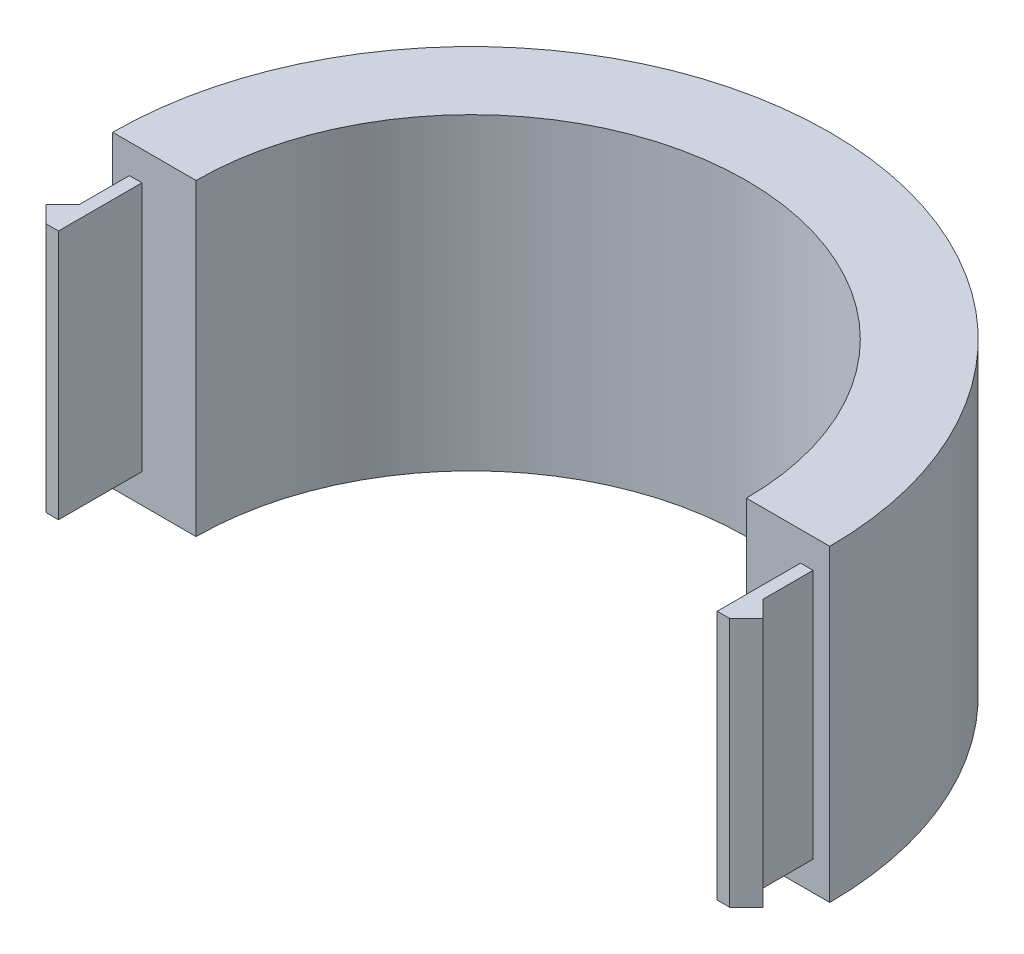
ISO-10303-21;
HEADER;
FILE_DESCRIPTION(('STEP AP214'),'2;1');
FILE_NAME('part.step','',(''),(''),'','','');
FILE_SCHEMA(('AUTOMOTIVE_DESIGN { 1 0 10303 214 1 1 1 1 }'));
ENDSEC;
DATA;
#1=APPLICATION_CONTEXT('core data for automotive mechanical design processes');
#2=APPLICATION_PROTOCOL_DEFINITION('international standard','automotive_design',2000,#1);
#3=PRODUCT_CONTEXT('',#1,'mechanical');
#4=PRODUCT('Part','Part','',(#3));
#5=PRODUCT_RELATED_PRODUCT_CATEGORY('part','',(#4));
#6=PRODUCT_DEFINITION_FORMATION('','',#4);
#7=PRODUCT_DEFINITION_CONTEXT('part definition',#1,'design');
#8=PRODUCT_DEFINITION('design','',#6,#7);
#9=PRODUCT_DEFINITION_SHAPE('','',#8);
#10=(LENGTH_UNIT() NAMED_UNIT(*) SI_UNIT(.MILLI.,.METRE.));
#11=(NAMED_UNIT(*) PLANE_ANGLE_UNIT() SI_UNIT($,.RADIAN.));
#12=(NAMED_UNIT(*) SI_UNIT($,.STERADIAN.) SOLID_ANGLE_UNIT());
#13=UNCERTAINTY_MEASURE_WITH_UNIT(LENGTH_MEASURE(1.E-05),#10,'distance_accuracy_value','');
#14=(GEOMETRIC_REPRESENTATION_CONTEXT(3) GLOBAL_UNCERTAINTY_ASSIGNED_CONTEXT((#13)) GLOBAL_UNIT_ASSIGNED_CONTEXT((#10,
#11,#12)) REPRESENTATION_CONTEXT('',''));
#15=CARTESIAN_POINT('',(0.,0.,0.));
#16=DIRECTION('',(0.,0.,1.));
#17=DIRECTION('',(1.,0.,0.));
#18=AXIS2_PLACEMENT_3D('',#15,#16,#17);
#19=CARTESIAN_POINT('',(0.,37.,0.));
#20=DIRECTION('',(0.,0.,-1.));
#21=DIRECTION('',(-1.,0.,0.));
#22=AXIS2_PLACEMENT_3D('',#19,#20,#21);
#23=PLANE('',#22);
#24=DIRECTION('',(0.,-1.,0.));
#25=VECTOR('',#24,1.);
#26=CARTESIAN_POINT('',(39.5,33.5,0.));
#27=LINE('',#26,#25);
#28=CARTESIAN_POINT('',(39.5,33.5,0.));
#29=VERTEX_POINT('',#28);
#30=CARTESIAN_POINT('',(39.5,3.5,0.));
#31=VERTEX_POINT('',#30);
#32=EDGE_CURVE('E61',#29,#31,#27,.T.);
#33=ORIENTED_EDGE('',*,*,#32,.F.);
#34=DIRECTION('',(1.,0.,0.));
#35=VECTOR('',#34,1.);
#36=CARTESIAN_POINT('',(0.,33.5,0.));
#37=LINE('',#36,#35);
#38=CARTESIAN_POINT('',(41.,33.5,0.));
#39=VERTEX_POINT('',#38);
#40=EDGE_CURVE('E66',#29,#39,#37,.T.);
#41=ORIENTED_EDGE('',*,*,#40,.T.);
#42=DIRECTION('',(0.,-1.,0.));
#43=VECTOR('',#42,1.);
#44=CARTESIAN_POINT('',(41.,33.5,0.));
#45=LINE('',#44,#43);
#46=CARTESIAN_POINT('',(41.,3.5,0.));
#47=VERTEX_POINT('',#46);
#48=EDGE_CURVE('E193',#39,#47,#45,.T.);
#49=ORIENTED_EDGE('',*,*,#48,.T.);
#50=DIRECTION('',(1.,0.,0.));
#51=VECTOR('',#50,1.);
#52=CARTESIAN_POINT('',(0.,3.5,0.));
#53=LINE('',#52,#51);
#54=EDGE_CURVE('E194',#31,#47,#53,.T.);
#55=ORIENTED_EDGE('',*,*,#54,.F.);
#56=EDGE_LOOP('',(#33,#41,#49,#55));
#57=FACE_BOUND('',#56,.T.);
#58=DIRECTION('',(1.,0.,0.));
#59=VECTOR('',#58,1.);
#60=CARTESIAN_POINT('',(0.,0.,0.));
#61=LINE('',#60,#59);
#62=CARTESIAN_POINT('',(33.,0.,0.));
#63=VERTEX_POINT('',#62);
#64=CARTESIAN_POINT('',(43.,0.,0.));
#65=VERTEX_POINT('',#64);
#66=EDGE_CURVE('E292',#63,#65,#61,.T.);
#67=ORIENTED_EDGE('',*,*,#66,.T.);
#68=DIRECTION('',(0.,-1.,0.));
#69=VECTOR('',#68,1.);
#70=CARTESIAN_POINT('',(43.,37.,0.));
#71=LINE('',#70,#69);
#72=CARTESIAN_POINT('',(43.,37.,0.));
#73=VERTEX_POINT('',#72);
#74=EDGE_CURVE('E11',#73,#65,#71,.T.);
#75=ORIENTED_EDGE('',*,*,#74,.F.);
#76=DIRECTION('',(1.,0.,0.));
#77=VECTOR('',#76,1.);
#78=CARTESIAN_POINT('',(0.,37.,0.));
#79=LINE('',#78,#77);
#80=CARTESIAN_POINT('',(33.,37.,0.));
#81=VERTEX_POINT('',#80);
#82=EDGE_CURVE('E293',#81,#73,#79,.T.);
#83=ORIENTED_EDGE('',*,*,#82,.F.);
#84=DIRECTION('',(0.,-1.,0.));
#85=VECTOR('',#84,1.);
#86=CARTESIAN_POINT('',(33.,37.,0.));
#87=LINE('',#86,#85);
#88=EDGE_CURVE('E306',#81,#63,#87,.T.);
#89=ORIENTED_EDGE('',*,*,#88,.T.);
#90=EDGE_LOOP('',(#67,#75,#83,#89));
#91=FACE_BOUND('',#90,.T.);
#92=ADVANCED_FACE('F45',(#57,#91),#23,.F.);
#93=CARTESIAN_POINT('',(0.,37.,0.));
#94=DIRECTION('',(0.,-1.,0.));
#95=DIRECTION('',(0.,0.,-1.));
#96=AXIS2_PLACEMENT_3D('',#93,#94,#95);
#97=CYLINDRICAL_SURFACE('',#96,43.);
#98=CARTESIAN_POINT('',(0.,0.,0.));
#99=DIRECTION('',(0.,1.,0.));
#100=DIRECTION('',(0.,0.,1.));
#101=AXIS2_PLACEMENT_3D('',#98,#99,#100);
#102=CIRCLE('',#101,43.);
#103=CARTESIAN_POINT('',(-43.,0.,0.));
#104=VERTEX_POINT('',#103);
#105=EDGE_CURVE('E310',#65,#104,#102,.T.);
#106=ORIENTED_EDGE('',*,*,#105,.T.);
#107=DIRECTION('',(0.,-1.,0.));
#108=VECTOR('',#107,1.);
#109=CARTESIAN_POINT('',(-43.,37.,0.));
#110=LINE('',#109,#108);
#111=CARTESIAN_POINT('',(-43.,37.,0.));
#112=VERTEX_POINT('',#111);
#113=EDGE_CURVE('E54',#112,#104,#110,.T.);
#114=ORIENTED_EDGE('',*,*,#113,.F.);
#115=CARTESIAN_POINT('',(0.,37.,0.));
#116=DIRECTION('',(0.,1.,0.));
#117=DIRECTION('',(0.,0.,1.));
#118=AXIS2_PLACEMENT_3D('',#115,#116,#117);
#119=CIRCLE('',#118,43.);
#120=EDGE_CURVE('E297',#73,#112,#119,.T.);
#121=ORIENTED_EDGE('',*,*,#120,.F.);
#122=ORIENTED_EDGE('',*,*,#74,.T.);
#123=EDGE_LOOP('',(#106,#114,#121,#122));
#124=FACE_BOUND('',#123,.T.);
#125=ADVANCED_FACE('F47',(#124),#97,.T.);
#126=DIRECTION('',(0.,-1.,0.));
#127=VECTOR('',#126,1.);
#128=CARTESIAN_POINT('',(-41.,33.5,0.));
#129=LINE('',#128,#127);
#130=CARTESIAN_POINT('',(-41.,33.5,0.));
#131=VERTEX_POINT('',#130);
#132=CARTESIAN_POINT('',(-41.,3.5,0.));
#133=VERTEX_POINT('',#132);
#134=EDGE_CURVE('E288',#131,#133,#129,.T.);
#135=ORIENTED_EDGE('',*,*,#134,.F.);
#136=DIRECTION('',(-1.,0.,0.));
#137=VECTOR('',#136,1.);
#138=CARTESIAN_POINT('',(0.,33.5,0.));
#139=LINE('',#138,#137);
#140=CARTESIAN_POINT('',(-39.5,33.5,0.));
#141=VERTEX_POINT('',#140);
#142=EDGE_CURVE('E228',#141,#131,#139,.T.);
#143=ORIENTED_EDGE('',*,*,#142,.F.);
#144=DIRECTION('',(0.,-1.,0.));
#145=VECTOR('',#144,1.);
#146=CARTESIAN_POINT('',(-39.5,33.5,0.));
#147=LINE('',#146,#145);
#148=CARTESIAN_POINT('',(-39.5,3.5,0.));
#149=VERTEX_POINT('',#148);
#150=EDGE_CURVE('E252',#141,#149,#147,.T.);
#151=ORIENTED_EDGE('',*,*,#150,.T.);
#152=DIRECTION('',(-1.,0.,0.));
#153=VECTOR('',#152,1.);
#154=CARTESIAN_POINT('',(0.,3.5,0.));
#155=LINE('',#154,#153);
#156=EDGE_CURVE('E227',#149,#133,#155,.T.);
#157=ORIENTED_EDGE('',*,*,#156,.T.);
#158=EDGE_LOOP('',(#135,#143,#151,#157));
#159=FACE_BOUND('',#158,.T.);
#160=CARTESIAN_POINT('',(-33.,0.,0.));
#161=VERTEX_POINT('',#160);
#162=EDGE_CURVE('E311',#104,#161,#61,.T.);
#163=ORIENTED_EDGE('',*,*,#162,.T.);
#164=DIRECTION('',(0.,-1.,0.));
#165=VECTOR('',#164,1.);
#166=CARTESIAN_POINT('',(-33.,37.,0.));
#167=LINE('',#166,#165);
#168=CARTESIAN_POINT('',(-33.,37.,0.));
#169=VERTEX_POINT('',#168);
#170=EDGE_CURVE('E319',#169,#161,#167,.T.);
#171=ORIENTED_EDGE('',*,*,#170,.F.);
#172=EDGE_CURVE('E299',#112,#169,#79,.T.);
#173=ORIENTED_EDGE('',*,*,#172,.F.);
#174=ORIENTED_EDGE('',*,*,#113,.T.);
#175=EDGE_LOOP('',(#163,#171,#173,#174));
#176=FACE_BOUND('',#175,.T.);
#177=ADVANCED_FACE('F328',(#159,#176),#23,.F.);
#178=CARTESIAN_POINT('',(0.,37.,0.));
#179=DIRECTION('',(0.,-1.,0.));
#180=DIRECTION('',(0.,0.,-1.));
#181=AXIS2_PLACEMENT_3D('',#178,#179,#180);
#182=CYLINDRICAL_SURFACE('',#181,33.);
#183=CARTESIAN_POINT('',(0.,0.,0.));
#184=DIRECTION('',(0.,1.,0.));
#185=DIRECTION('',(0.,0.,1.));
#186=AXIS2_PLACEMENT_3D('',#183,#184,#185);
#187=CIRCLE('',#186,33.);
#188=EDGE_CURVE('E298',#63,#161,#187,.T.);
#189=ORIENTED_EDGE('',*,*,#188,.F.);
#190=ORIENTED_EDGE('',*,*,#88,.F.);
#191=CARTESIAN_POINT('',(0.,37.,0.));
#192=DIRECTION('',(0.,1.,0.));
#193=DIRECTION('',(0.,0.,1.));
#194=AXIS2_PLACEMENT_3D('',#191,#192,#193);
#195=CIRCLE('',#194,33.);
#196=EDGE_CURVE('E302',#81,#169,#195,.T.);
#197=ORIENTED_EDGE('',*,*,#196,.T.);
#198=ORIENTED_EDGE('',*,*,#170,.T.);
#199=EDGE_LOOP('',(#189,#190,#197,#198));
#200=FACE_BOUND('',#199,.T.);
#201=ADVANCED_FACE('F341',(#200),#182,.F.);
#202=CARTESIAN_POINT('',(0.,37.,0.));
#203=DIRECTION('',(0.,1.,0.));
#204=DIRECTION('',(0.,0.,1.));
#205=AXIS2_PLACEMENT_3D('',#202,#203,#204);
#206=PLANE('',#205);
#207=ORIENTED_EDGE('',*,*,#82,.T.);
#208=ORIENTED_EDGE('',*,*,#120,.T.);
#209=ORIENTED_EDGE('',*,*,#172,.T.);
#210=ORIENTED_EDGE('',*,*,#196,.F.);
#211=EDGE_LOOP('',(#207,#208,#209,#210));
#212=FACE_BOUND('',#211,.T.);
#213=ADVANCED_FACE('F339',(#212),#206,.T.);
#214=CARTESIAN_POINT('',(0.,0.,0.));
#215=DIRECTION('',(0.,1.,0.));
#216=DIRECTION('',(0.,0.,1.));
#217=AXIS2_PLACEMENT_3D('',#214,#215,#216);
#218=PLANE('',#217);
#219=ORIENTED_EDGE('',*,*,#66,.F.);
#220=ORIENTED_EDGE('',*,*,#188,.T.);
#221=ORIENTED_EDGE('',*,*,#162,.F.);
#222=ORIENTED_EDGE('',*,*,#105,.F.);
#223=EDGE_LOOP('',(#219,#220,#221,#222));
#224=FACE_BOUND('',#223,.T.);
#225=ADVANCED_FACE('F333',(#224),#218,.F.);
#226=CARTESIAN_POINT('',(-41.,33.5,0.));
#227=DIRECTION('',(1.,0.,0.));
#228=DIRECTION('',(0.,0.,-1.));
#229=AXIS2_PLACEMENT_3D('',#226,#227,#228);
#230=PLANE('',#229);
#231=DIRECTION('',(0.,0.,1.));
#232=VECTOR('',#231,1.);
#233=CARTESIAN_POINT('',(-41.,3.5,0.));
#234=LINE('',#233,#232);
#235=CARTESIAN_POINT('',(-41.,3.5,5.99999999999995));
#236=VERTEX_POINT('',#235);
#237=EDGE_CURVE('E255',#133,#236,#234,.T.);
#238=ORIENTED_EDGE('',*,*,#237,.T.);
#239=DIRECTION('',(0.,-1.,0.));
#240=VECTOR('',#239,1.);
#241=CARTESIAN_POINT('',(-41.,33.5,5.99999999999995));
#242=LINE('',#241,#240);
#243=CARTESIAN_POINT('',(-41.,33.5,5.99999999999995));
#244=VERTEX_POINT('',#243);
#245=EDGE_CURVE('E285',#244,#236,#242,.T.);
#246=ORIENTED_EDGE('',*,*,#245,.F.);
#247=DIRECTION('',(0.,0.,1.));
#248=VECTOR('',#247,1.);
#249=CARTESIAN_POINT('',(-41.,33.5,0.));
#250=LINE('',#249,#248);
#251=EDGE_CURVE('E232',#131,#244,#250,.T.);
#252=ORIENTED_EDGE('',*,*,#251,.F.);
#253=ORIENTED_EDGE('',*,*,#134,.T.);
#254=EDGE_LOOP('',(#238,#246,#252,#253));
#255=FACE_BOUND('',#254,.T.);
#256=ADVANCED_FACE('F358',(#255),#230,.F.);
#257=CARTESIAN_POINT('',(-17.5000000000003,33.5,-17.5000000000001));
#258=DIRECTION('',(-0.707106781186552,0.,-0.707106781186543));
#259=DIRECTION('',(-0.707106781186543,0.,0.707106781186552));
#260=AXIS2_PLACEMENT_3D('',#257,#258,#259);
#261=PLANE('',#260);
#262=DIRECTION('',(0.707106781186543,0.,-0.707106781186552));
#263=VECTOR('',#262,1.);
#264=CARTESIAN_POINT('',(-17.5000000000003,3.5,-17.5000000000001));
#265=LINE('',#264,#263);
#266=CARTESIAN_POINT('',(-43.,3.5,7.99999999999998));
#267=VERTEX_POINT('',#266);
#268=EDGE_CURVE('E259',#267,#236,#265,.T.);
#269=ORIENTED_EDGE('',*,*,#268,.F.);
#270=DIRECTION('',(0.,-1.,0.));
#271=VECTOR('',#270,1.);
#272=CARTESIAN_POINT('',(-43.,33.5,7.99999999999998));
#273=LINE('',#272,#271);
#274=CARTESIAN_POINT('',(-43.,33.5,7.99999999999998));
#275=VERTEX_POINT('',#274);
#276=EDGE_CURVE('E282',#275,#267,#273,.T.);
#277=ORIENTED_EDGE('',*,*,#276,.F.);
#278=DIRECTION('',(0.707106781186543,0.,-0.707106781186552));
#279=VECTOR('',#278,1.);
#280=CARTESIAN_POINT('',(-17.5000000000003,33.5,-17.5000000000001));
#281=LINE('',#280,#279);
#282=EDGE_CURVE('E236',#275,#244,#281,.T.);
#283=ORIENTED_EDGE('',*,*,#282,.T.);
#284=ORIENTED_EDGE('',*,*,#245,.T.);
#285=EDGE_LOOP('',(#269,#277,#283,#284));
#286=FACE_BOUND('',#285,.T.);
#287=ADVANCED_FACE('F363',(#286),#261,.T.);
#288=CARTESIAN_POINT('',(-25.5000000000002,33.5,25.5));
#289=DIRECTION('',(-0.707106781186551,0.,0.707106781186544));
#290=DIRECTION('',(0.707106781186544,0.,0.707106781186551));
#291=AXIS2_PLACEMENT_3D('',#288,#289,#290);
#292=PLANE('',#291);
#293=DIRECTION('',(-0.707106781186544,0.,-0.707106781186551));
#294=VECTOR('',#293,1.);
#295=CARTESIAN_POINT('',(-25.5000000000002,3.5,25.5));
#296=LINE('',#295,#294);
#297=CARTESIAN_POINT('',(-41.,3.5,10.));
#298=VERTEX_POINT('',#297);
#299=EDGE_CURVE('E263',#298,#267,#296,.T.);
#300=ORIENTED_EDGE('',*,*,#299,.F.);
#301=DIRECTION('',(0.,-1.,0.));
#302=VECTOR('',#301,1.);
#303=CARTESIAN_POINT('',(-41.,33.5,10.));
#304=LINE('',#303,#302);
#305=CARTESIAN_POINT('',(-41.,33.5,10.));
#306=VERTEX_POINT('',#305);
#307=EDGE_CURVE('E279',#306,#298,#304,.T.);
#308=ORIENTED_EDGE('',*,*,#307,.F.);
#309=DIRECTION('',(-0.707106781186544,0.,-0.707106781186551));
#310=VECTOR('',#309,1.);
#311=CARTESIAN_POINT('',(-25.5000000000002,33.5,25.5));
#312=LINE('',#311,#310);
#313=EDGE_CURVE('E240',#306,#275,#312,.T.);
#314=ORIENTED_EDGE('',*,*,#313,.T.);
#315=ORIENTED_EDGE('',*,*,#276,.T.);
#316=EDGE_LOOP('',(#300,#308,#314,#315));
#317=FACE_BOUND('',#316,.T.);
#318=ADVANCED_FACE('F367',(#317),#292,.T.);
#319=CARTESIAN_POINT('',(0.,33.5,9.99999999999995));
#320=DIRECTION('',(0.,0.,1.));
#321=DIRECTION('',(1.,0.,0.));
#322=AXIS2_PLACEMENT_3D('',#319,#320,#321);
#323=PLANE('',#322);
#324=DIRECTION('',(-1.,0.,0.));
#325=VECTOR('',#324,1.);
#326=CARTESIAN_POINT('',(0.,3.5,9.99999999999995));
#327=LINE('',#326,#325);
#328=CARTESIAN_POINT('',(-39.5,3.5,10.));
#329=VERTEX_POINT('',#328);
#330=EDGE_CURVE('E267',#329,#298,#327,.T.);
#331=ORIENTED_EDGE('',*,*,#330,.F.);
#332=DIRECTION('',(0.,-1.,0.));
#333=VECTOR('',#332,1.);
#334=CARTESIAN_POINT('',(-39.5,33.5,10.));
#335=LINE('',#334,#333);
#336=CARTESIAN_POINT('',(-39.5,33.5,10.));
#337=VERTEX_POINT('',#336);
#338=EDGE_CURVE('E276',#337,#329,#335,.T.);
#339=ORIENTED_EDGE('',*,*,#338,.F.);
#340=DIRECTION('',(-1.,0.,0.));
#341=VECTOR('',#340,1.);
#342=CARTESIAN_POINT('',(0.,33.5,9.99999999999995));
#343=LINE('',#342,#341);
#344=EDGE_CURVE('E244',#337,#306,#343,.T.);
#345=ORIENTED_EDGE('',*,*,#344,.T.);
#346=ORIENTED_EDGE('',*,*,#307,.T.);
#347=EDGE_LOOP('',(#331,#339,#345,#346));
#348=FACE_BOUND('',#347,.T.);
#349=ADVANCED_FACE('F371',(#348),#323,.T.);
#350=CARTESIAN_POINT('',(-39.5,33.5,0.));
#351=DIRECTION('',(1.,0.,0.));
#352=DIRECTION('',(0.,0.,-1.));
#353=AXIS2_PLACEMENT_3D('',#350,#351,#352);
#354=PLANE('',#353);
#355=DIRECTION('',(0.,0.,1.));
#356=VECTOR('',#355,1.);
#357=CARTESIAN_POINT('',(-39.5,3.5,0.));
#358=LINE('',#357,#356);
#359=EDGE_CURVE('E233',#149,#329,#358,.T.);
#360=ORIENTED_EDGE('',*,*,#359,.F.);
#361=ORIENTED_EDGE('',*,*,#150,.F.);
#362=DIRECTION('',(0.,0.,1.));
#363=VECTOR('',#362,1.);
#364=CARTESIAN_POINT('',(-39.5,33.5,0.));
#365=LINE('',#364,#363);
#366=EDGE_CURVE('E248',#141,#337,#365,.T.);
#367=ORIENTED_EDGE('',*,*,#366,.T.);
#368=ORIENTED_EDGE('',*,*,#338,.T.);
#369=EDGE_LOOP('',(#360,#361,#367,#368));
#370=FACE_BOUND('',#369,.T.);
#371=ADVANCED_FACE('F375',(#370),#354,.T.);
#372=CARTESIAN_POINT('',(0.,33.5,0.));
#373=DIRECTION('',(0.,1.,0.));
#374=DIRECTION('',(0.,0.,1.));
#375=AXIS2_PLACEMENT_3D('',#372,#373,#374);
#376=PLANE('',#375);
#377=ORIENTED_EDGE('',*,*,#142,.T.);
#378=ORIENTED_EDGE('',*,*,#251,.T.);
#379=ORIENTED_EDGE('',*,*,#282,.F.);
#380=ORIENTED_EDGE('',*,*,#313,.F.);
#381=ORIENTED_EDGE('',*,*,#344,.F.);
#382=ORIENTED_EDGE('',*,*,#366,.F.);
#383=EDGE_LOOP('',(#377,#378,#379,#380,#381,#382));
#384=FACE_BOUND('',#383,.T.);
#385=ADVANCED_FACE('F379',(#384),#376,.T.);
#386=CARTESIAN_POINT('',(0.,3.5,0.));
#387=DIRECTION('',(0.,1.,0.));
#388=DIRECTION('',(0.,0.,1.));
#389=AXIS2_PLACEMENT_3D('',#386,#387,#388);
#390=PLANE('',#389);
#391=ORIENTED_EDGE('',*,*,#156,.F.);
#392=ORIENTED_EDGE('',*,*,#359,.T.);
#393=ORIENTED_EDGE('',*,*,#330,.T.);
#394=ORIENTED_EDGE('',*,*,#299,.T.);
#395=ORIENTED_EDGE('',*,*,#268,.T.);
#396=ORIENTED_EDGE('',*,*,#237,.F.);
#397=EDGE_LOOP('',(#391,#392,#393,#394,#395,#396));
#398=FACE_BOUND('',#397,.T.);
#399=ADVANCED_FACE('F381',(#398),#390,.F.);
#400=CARTESIAN_POINT('',(39.5,33.5,0.));
#401=DIRECTION('',(1.,0.,0.));
#402=DIRECTION('',(0.,0.,-1.));
#403=AXIS2_PLACEMENT_3D('',#400,#401,#402);
#404=PLANE('',#403);
#405=DIRECTION('',(0.,0.,1.));
#406=VECTOR('',#405,1.);
#407=CARTESIAN_POINT('',(39.5,3.5,0.));
#408=LINE('',#407,#406);
#409=CARTESIAN_POINT('',(39.5,3.5,10.));
#410=VERTEX_POINT('',#409);
#411=EDGE_CURVE('E170',#31,#410,#408,.T.);
#412=ORIENTED_EDGE('',*,*,#411,.T.);
#413=DIRECTION('',(0.,-1.,0.));
#414=VECTOR('',#413,1.);
#415=CARTESIAN_POINT('',(39.5,33.5,10.));
#416=LINE('',#415,#414);
#417=CARTESIAN_POINT('',(39.5,33.5,10.));
#418=VERTEX_POINT('',#417);
#419=EDGE_CURVE('E167',#418,#410,#416,.T.);
#420=ORIENTED_EDGE('',*,*,#419,.F.);
#421=DIRECTION('',(0.,0.,1.));
#422=VECTOR('',#421,1.);
#423=CARTESIAN_POINT('',(39.5,33.5,0.));
#424=LINE('',#423,#422);
#425=EDGE_CURVE('E156',#29,#418,#424,.T.);
#426=ORIENTED_EDGE('',*,*,#425,.F.);
#427=ORIENTED_EDGE('',*,*,#32,.T.);
#428=EDGE_LOOP('',(#412,#420,#426,#427));
#429=FACE_BOUND('',#428,.T.);
#430=ADVANCED_FACE('F168',(#429),#404,.F.);
#431=CARTESIAN_POINT('',(0.,33.5,9.99999999999995));
#432=DIRECTION('',(0.,0.,-1.));
#433=DIRECTION('',(-1.,0.,0.));
#434=AXIS2_PLACEMENT_3D('',#431,#432,#433);
#435=PLANE('',#434);
#436=DIRECTION('',(1.,0.,0.));
#437=VECTOR('',#436,1.);
#438=CARTESIAN_POINT('',(0.,3.5,9.99999999999995));
#439=LINE('',#438,#437);
#440=CARTESIAN_POINT('',(41.,3.5,10.));
#441=VERTEX_POINT('',#440);
#442=EDGE_CURVE('E200',#410,#441,#439,.T.);
#443=ORIENTED_EDGE('',*,*,#442,.T.);
#444=DIRECTION('',(0.,-1.,0.));
#445=VECTOR('',#444,1.);
#446=CARTESIAN_POINT('',(41.,33.5,10.));
#447=LINE('',#446,#445);
#448=CARTESIAN_POINT('',(41.,33.5,10.));
#449=VERTEX_POINT('',#448);
#450=EDGE_CURVE('E174',#449,#441,#447,.T.);
#451=ORIENTED_EDGE('',*,*,#450,.F.);
#452=DIRECTION('',(1.,0.,0.));
#453=VECTOR('',#452,1.);
#454=CARTESIAN_POINT('',(0.,33.5,9.99999999999995));
#455=LINE('',#454,#453);
#456=EDGE_CURVE('E160',#418,#449,#455,.T.);
#457=ORIENTED_EDGE('',*,*,#456,.F.);
#458=ORIENTED_EDGE('',*,*,#419,.T.);
#459=EDGE_LOOP('',(#443,#451,#457,#458));
#460=FACE_BOUND('',#459,.T.);
#461=ADVANCED_FACE('F176',(#460),#435,.F.);
#462=CARTESIAN_POINT('',(25.5000000000002,33.5,25.5));
#463=DIRECTION('',(-0.707106781186551,0.,-0.707106781186544));
#464=DIRECTION('',(-0.707106781186544,0.,0.707106781186551));
#465=AXIS2_PLACEMENT_3D('',#462,#463,#464);
#466=PLANE('',#465);
#467=DIRECTION('',(0.707106781186544,0.,-0.707106781186551));
#468=VECTOR('',#467,1.);
#469=CARTESIAN_POINT('',(25.5000000000002,3.5,25.5));
#470=LINE('',#469,#468);
#471=CARTESIAN_POINT('',(43.,3.5,7.99999999999998));
#472=VERTEX_POINT('',#471);
#473=EDGE_CURVE('E203',#441,#472,#470,.T.);
#474=ORIENTED_EDGE('',*,*,#473,.T.);
#475=DIRECTION('',(0.,-1.,0.));
#476=VECTOR('',#475,1.);
#477=CARTESIAN_POINT('',(43.,33.5,7.99999999999998));
#478=LINE('',#477,#476);
#479=CARTESIAN_POINT('',(43.,33.5,7.99999999999998));
#480=VERTEX_POINT('',#479);
#481=EDGE_CURVE('E219',#480,#472,#478,.T.);
#482=ORIENTED_EDGE('',*,*,#481,.F.);
#483=DIRECTION('',(0.707106781186544,0.,-0.707106781186551));
#484=VECTOR('',#483,1.);
#485=CARTESIAN_POINT('',(25.5000000000002,33.5,25.5));
#486=LINE('',#485,#484);
#487=EDGE_CURVE('E180',#449,#480,#486,.T.);
#488=ORIENTED_EDGE('',*,*,#487,.F.);
#489=ORIENTED_EDGE('',*,*,#450,.T.);
#490=EDGE_LOOP('',(#474,#482,#488,#489));
#491=FACE_BOUND('',#490,.T.);
#492=ADVANCED_FACE('F392',(#491),#466,.F.);
#493=CARTESIAN_POINT('',(17.5000000000003,33.5,-17.5000000000001));
#494=DIRECTION('',(-0.707106781186552,0.,0.707106781186543));
#495=DIRECTION('',(0.707106781186543,0.,0.707106781186552));
#496=AXIS2_PLACEMENT_3D('',#493,#494,#495);
#497=PLANE('',#496);
#498=DIRECTION('',(-0.707106781186543,0.,-0.707106781186552));
#499=VECTOR('',#498,1.);
#500=CARTESIAN_POINT('',(17.5000000000003,3.5,-17.5000000000001));
#501=LINE('',#500,#499);
#502=CARTESIAN_POINT('',(41.,3.5,5.99999999999995));
#503=VERTEX_POINT('',#502);
#504=EDGE_CURVE('E206',#472,#503,#501,.T.);
#505=ORIENTED_EDGE('',*,*,#504,.T.);
#506=DIRECTION('',(0.,-1.,0.));
#507=VECTOR('',#506,1.);
#508=CARTESIAN_POINT('',(41.,33.5,5.99999999999995));
#509=LINE('',#508,#507);
#510=CARTESIAN_POINT('',(41.,33.5,5.99999999999995));
#511=VERTEX_POINT('',#510);
#512=EDGE_CURVE('E216',#511,#503,#509,.T.);
#513=ORIENTED_EDGE('',*,*,#512,.F.);
#514=DIRECTION('',(-0.707106781186543,0.,-0.707106781186552));
#515=VECTOR('',#514,1.);
#516=CARTESIAN_POINT('',(17.5000000000003,33.5,-17.5000000000001));
#517=LINE('',#516,#515);
#518=EDGE_CURVE('E183',#480,#511,#517,.T.);
#519=ORIENTED_EDGE('',*,*,#518,.F.);
#520=ORIENTED_EDGE('',*,*,#481,.T.);
#521=EDGE_LOOP('',(#505,#513,#519,#520));
#522=FACE_BOUND('',#521,.T.);
#523=ADVANCED_FACE('F395',(#522),#497,.F.);
#524=CARTESIAN_POINT('',(41.,33.5,0.));
#525=DIRECTION('',(1.,0.,0.));
#526=DIRECTION('',(0.,0.,-1.));
#527=AXIS2_PLACEMENT_3D('',#524,#525,#526);
#528=PLANE('',#527);
#529=DIRECTION('',(0.,0.,1.));
#530=VECTOR('',#529,1.);
#531=CARTESIAN_POINT('',(41.,3.5,0.));
#532=LINE('',#531,#530);
#533=EDGE_CURVE('E210',#47,#503,#532,.T.);
#534=ORIENTED_EDGE('',*,*,#533,.F.);
#535=ORIENTED_EDGE('',*,*,#48,.F.);
#536=DIRECTION('',(0.,0.,1.));
#537=VECTOR('',#536,1.);
#538=CARTESIAN_POINT('',(41.,33.5,0.));
#539=LINE('',#538,#537);
#540=EDGE_CURVE('E189',#39,#511,#539,.T.);
#541=ORIENTED_EDGE('',*,*,#540,.T.);
#542=ORIENTED_EDGE('',*,*,#512,.T.);
#543=EDGE_LOOP('',(#534,#535,#541,#542));
#544=FACE_BOUND('',#543,.T.);
#545=ADVANCED_FACE('F399',(#544),#528,.T.);
#546=CARTESIAN_POINT('',(0.,33.5,0.));
#547=DIRECTION('',(0.,1.,0.));
#548=DIRECTION('',(0.,0.,1.));
#549=AXIS2_PLACEMENT_3D('',#546,#547,#548);
#550=PLANE('',#549);
#551=ORIENTED_EDGE('',*,*,#40,.F.);
#552=ORIENTED_EDGE('',*,*,#425,.T.);
#553=ORIENTED_EDGE('',*,*,#456,.T.);
#554=ORIENTED_EDGE('',*,*,#487,.T.);
#555=ORIENTED_EDGE('',*,*,#518,.T.);
#556=ORIENTED_EDGE('',*,*,#540,.F.);
#557=EDGE_LOOP('',(#551,#552,#553,#554,#555,#556));
#558=FACE_BOUND('',#557,.T.);
#559=ADVANCED_FACE('F158',(#558),#550,.T.);
#560=CARTESIAN_POINT('',(0.,3.5,0.));
#561=DIRECTION('',(0.,1.,0.));
#562=DIRECTION('',(0.,0.,1.));
#563=AXIS2_PLACEMENT_3D('',#560,#561,#562);
#564=PLANE('',#563);
#565=ORIENTED_EDGE('',*,*,#54,.T.);
#566=ORIENTED_EDGE('',*,*,#533,.T.);
#567=ORIENTED_EDGE('',*,*,#504,.F.);
#568=ORIENTED_EDGE('',*,*,#473,.F.);
#569=ORIENTED_EDGE('',*,*,#442,.F.);
#570=ORIENTED_EDGE('',*,*,#411,.F.);
#571=EDGE_LOOP('',(#565,#566,#567,#568,#569,#570));
#572=FACE_BOUND('',#571,.T.);
#573=ADVANCED_FACE('F404',(#572),#564,.F.);
#574=CLOSED_SHELL('',(#92,#125,#177,#201,#213,#225,#256,#287,#318,#349,#371,#385,#399,#430,#461,
#492,#523,#545,#559,#573));
#575=MANIFOLD_SOLID_BREP('B2',#574);
#576=ADVANCED_BREP_SHAPE_REPRESENTATION('',(#18,#575),#14);
#577=SHAPE_DEFINITION_REPRESENTATION(#9,#576);
ENDSEC;
END-ISO-10303-21;
